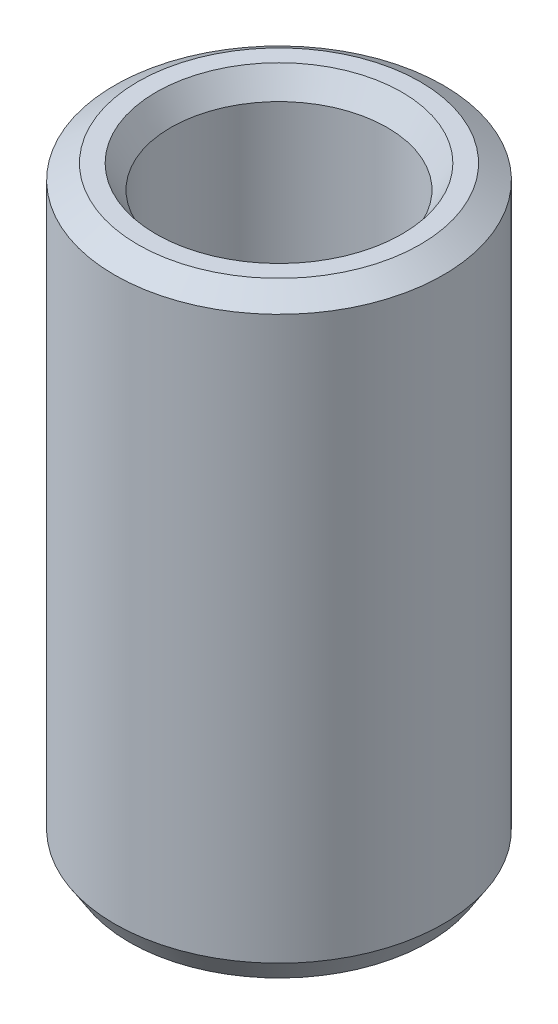
ISO-10303-21;
HEADER;
FILE_DESCRIPTION(('STEP AP214'),'2;1');
FILE_NAME('part.step','',(''),(''),'','','');
FILE_SCHEMA(('AUTOMOTIVE_DESIGN { 1 0 10303 214 1 1 1 1 }'));
ENDSEC;
DATA;
#1=APPLICATION_CONTEXT('core data for automotive mechanical design processes');
#2=APPLICATION_PROTOCOL_DEFINITION('international standard','automotive_design',2000,#1);
#3=PRODUCT_CONTEXT('',#1,'mechanical');
#4=PRODUCT('Part','Part','',(#3));
#5=PRODUCT_RELATED_PRODUCT_CATEGORY('part','',(#4));
#6=PRODUCT_DEFINITION_FORMATION('','',#4);
#7=PRODUCT_DEFINITION_CONTEXT('part definition',#1,'design');
#8=PRODUCT_DEFINITION('design','',#6,#7);
#9=PRODUCT_DEFINITION_SHAPE('','',#8);
#10=(LENGTH_UNIT() NAMED_UNIT(*) SI_UNIT(.MILLI.,.METRE.));
#11=(NAMED_UNIT(*) PLANE_ANGLE_UNIT() SI_UNIT($,.RADIAN.));
#12=(NAMED_UNIT(*) SI_UNIT($,.STERADIAN.) SOLID_ANGLE_UNIT());
#13=UNCERTAINTY_MEASURE_WITH_UNIT(LENGTH_MEASURE(1.E-05),#10,'distance_accuracy_value','');
#14=(GEOMETRIC_REPRESENTATION_CONTEXT(3) GLOBAL_UNCERTAINTY_ASSIGNED_CONTEXT((#13)) GLOBAL_UNIT_ASSIGNED_CONTEXT((#10,
#11,#12)) REPRESENTATION_CONTEXT('',''));
#15=CARTESIAN_POINT('',(0.,0.,0.));
#16=DIRECTION('',(0.,0.,1.));
#17=DIRECTION('',(1.,0.,0.));
#18=AXIS2_PLACEMENT_3D('',#15,#16,#17);
#19=CARTESIAN_POINT('',(0.,63.8823352774952,0.));
#20=DIRECTION('',(0.,-1.,0.));
#21=DIRECTION('',(0.,0.,-1.));
#22=AXIS2_PLACEMENT_3D('',#19,#20,#21);
#23=CYLINDRICAL_SURFACE('',#22,17.5);
#24=CARTESIAN_POINT('',(0.,2.47226229727942,0.));
#25=DIRECTION('',(0.,1.,0.));
#26=DIRECTION('',(0.,0.,1.));
#27=AXIS2_PLACEMENT_3D('',#24,#25,#26);
#28=CIRCLE('',#27,17.5);
#29=CARTESIAN_POINT('',(0.,2.47226229727942,17.5));
#30=VERTEX_POINT('',#29);
#31=EDGE_CURVE('E10',#30,#30,#28,.T.);
#32=ORIENTED_EDGE('',*,*,#31,.T.);
#33=EDGE_LOOP('',(#32));
#34=FACE_BOUND('',#33,.T.);
#35=CARTESIAN_POINT('',(0.,62.3115383944916,0.));
#36=DIRECTION('',(0.,1.,0.));
#37=DIRECTION('',(0.,0.,1.));
#38=AXIS2_PLACEMENT_3D('',#35,#36,#37);
#39=CIRCLE('',#38,17.5);
#40=CARTESIAN_POINT('',(0.,62.3115383944916,17.5));
#41=VERTEX_POINT('',#40);
#42=EDGE_CURVE('E50',#41,#41,#39,.F.);
#43=ORIENTED_EDGE('',*,*,#42,.T.);
#44=EDGE_LOOP('',(#43));
#45=FACE_BOUND('',#44,.T.);
#46=ADVANCED_FACE('F39',(#34,#45),#23,.T.);
#47=CARTESIAN_POINT('',(0.,63.8823352774952,0.));
#48=DIRECTION('',(0.,1.,0.));
#49=DIRECTION('',(0.,0.,1.));
#50=AXIS2_PLACEMENT_3D('',#47,#48,#49);
#51=PLANE('',#50);
#52=CARTESIAN_POINT('',(0.,63.8823352774952,0.));
#53=DIRECTION('',(0.,1.,0.));
#54=DIRECTION('',(0.,0.,1.));
#55=AXIS2_PLACEMENT_3D('',#52,#53,#54);
#56=CIRCLE('',#55,13.0926571755397);
#57=CARTESIAN_POINT('',(0.,63.8823352774952,13.0926571755397));
#58=VERTEX_POINT('',#57);
#59=EDGE_CURVE('E58',#58,#58,#56,.F.);
#60=ORIENTED_EDGE('',*,*,#59,.T.);
#61=EDGE_LOOP('',(#60));
#62=FACE_BOUND('',#61,.T.);
#63=CARTESIAN_POINT('',(0.,63.8823352774952,0.));
#64=DIRECTION('',(0.,1.,0.));
#65=DIRECTION('',(0.,0.,1.));
#66=AXIS2_PLACEMENT_3D('',#63,#64,#65);
#67=CIRCLE('',#66,15.0277377027206);
#68=CARTESIAN_POINT('',(0.,63.8823352774952,15.0277377027206));
#69=VERTEX_POINT('',#68);
#70=EDGE_CURVE('E61',#69,#69,#67,.T.);
#71=ORIENTED_EDGE('',*,*,#70,.T.);
#72=EDGE_LOOP('',(#71));
#73=FACE_BOUND('',#72,.T.);
#74=ADVANCED_FACE('F88',(#62,#73),#51,.T.);
#75=CARTESIAN_POINT('',(0.,0.,0.));
#76=DIRECTION('',(0.,1.,0.));
#77=DIRECTION('',(0.,0.,1.));
#78=AXIS2_PLACEMENT_3D('',#75,#76,#77);
#79=PLANE('',#78);
#80=CARTESIAN_POINT('',(0.,0.,0.));
#81=DIRECTION('',(0.,1.,0.));
#82=DIRECTION('',(0.,0.,1.));
#83=AXIS2_PLACEMENT_3D('',#80,#81,#82);
#84=CIRCLE('',#83,13.9941225898156);
#85=CARTESIAN_POINT('',(0.,0.,13.9941225898156));
#86=VERTEX_POINT('',#85);
#87=EDGE_CURVE('E51',#86,#86,#84,.T.);
#88=ORIENTED_EDGE('',*,*,#87,.T.);
#89=EDGE_LOOP('',(#88));
#90=FACE_BOUND('',#89,.T.);
#91=CARTESIAN_POINT('',(0.,0.,0.));
#92=DIRECTION('',(0.,1.,0.));
#93=DIRECTION('',(0.,0.,1.));
#94=AXIS2_PLACEMENT_3D('',#91,#92,#93);
#95=CIRCLE('',#94,15.9292031169964);
#96=CARTESIAN_POINT('',(0.,0.,15.9292031169964));
#97=VERTEX_POINT('',#96);
#98=EDGE_CURVE('E54',#97,#97,#95,.F.);
#99=ORIENTED_EDGE('',*,*,#98,.T.);
#100=EDGE_LOOP('',(#99));
#101=FACE_BOUND('',#100,.T.);
#102=ADVANCED_FACE('F83',(#90,#101),#79,.F.);
#103=CARTESIAN_POINT('',(0.,63.8823352774952,0.));
#104=DIRECTION('',(0.,-1.,0.));
#105=DIRECTION('',(0.,0.,-1.));
#106=AXIS2_PLACEMENT_3D('',#103,#104,#105);
#107=CYLINDRICAL_SURFACE('',#106,11.5218602925361);
#108=CARTESIAN_POINT('',(0.,61.4100729802158,0.));
#109=DIRECTION('',(0.,1.,0.));
#110=DIRECTION('',(0.,0.,1.));
#111=AXIS2_PLACEMENT_3D('',#108,#109,#110);
#112=CIRCLE('',#111,11.5218602925361);
#113=CARTESIAN_POINT('',(0.,61.4100729802158,11.5218602925361));
#114=VERTEX_POINT('',#113);
#115=EDGE_CURVE('E67',#114,#114,#112,.T.);
#116=ORIENTED_EDGE('',*,*,#115,.T.);
#117=EDGE_LOOP('',(#116));
#118=FACE_BOUND('',#117,.T.);
#119=CARTESIAN_POINT('',(0.,1.57079688300361,0.));
#120=DIRECTION('',(0.,1.,0.));
#121=DIRECTION('',(0.,0.,1.));
#122=AXIS2_PLACEMENT_3D('',#119,#120,#121);
#123=CIRCLE('',#122,11.5218602925361);
#124=CARTESIAN_POINT('',(0.,1.57079688300361,11.5218602925361));
#125=VERTEX_POINT('',#124);
#126=EDGE_CURVE('E69',#125,#125,#123,.F.);
#127=ORIENTED_EDGE('',*,*,#126,.T.);
#128=EDGE_LOOP('',(#127));
#129=FACE_BOUND('',#128,.T.);
#130=ADVANCED_FACE('F71',(#118,#129),#107,.F.);
#131=CARTESIAN_POINT('',(0.,61.4100729802158,0.));
#132=DIRECTION('',(0.,1.,0.));
#133=DIRECTION('',(0.,0.,1.));
#134=AXIS2_PLACEMENT_3D('',#131,#132,#133);
#135=CONICAL_SURFACE('',#134,11.5218602925361,0.566020392310707);
#136=ORIENTED_EDGE('',*,*,#59,.F.);
#137=EDGE_LOOP('',(#136));
#138=FACE_BOUND('',#137,.T.);
#139=ORIENTED_EDGE('',*,*,#115,.F.);
#140=EDGE_LOOP('',(#139));
#141=FACE_BOUND('',#140,.T.);
#142=ADVANCED_FACE('F77',(#138,#141),#135,.F.);
#143=CARTESIAN_POINT('',(0.,0.,0.));
#144=DIRECTION('',(0.,-1.,0.));
#145=DIRECTION('',(0.,0.,-1.));
#146=AXIS2_PLACEMENT_3D('',#143,#144,#145);
#147=CONICAL_SURFACE('',#146,13.9941225898156,1.00477593448419);
#148=ORIENTED_EDGE('',*,*,#126,.F.);
#149=EDGE_LOOP('',(#148));
#150=FACE_BOUND('',#149,.T.);
#151=ORIENTED_EDGE('',*,*,#87,.F.);
#152=EDGE_LOOP('',(#151));
#153=FACE_BOUND('',#152,.T.);
#154=ADVANCED_FACE('F73',(#150,#153),#147,.F.);
#155=CARTESIAN_POINT('',(0.,2.47226229727942,0.));
#156=DIRECTION('',(0.,1.,0.));
#157=DIRECTION('',(0.,0.,1.));
#158=AXIS2_PLACEMENT_3D('',#155,#156,#157);
#159=CONICAL_SURFACE('',#158,17.5,0.566020392310707);
#160=ORIENTED_EDGE('',*,*,#98,.F.);
#161=EDGE_LOOP('',(#160));
#162=FACE_BOUND('',#161,.T.);
#163=ORIENTED_EDGE('',*,*,#31,.F.);
#164=EDGE_LOOP('',(#163));
#165=FACE_BOUND('',#164,.T.);
#166=ADVANCED_FACE('F76',(#162,#165),#159,.T.);
#167=CARTESIAN_POINT('',(0.,63.8823352774952,0.));
#168=DIRECTION('',(0.,-1.,0.));
#169=DIRECTION('',(0.,0.,-1.));
#170=AXIS2_PLACEMENT_3D('',#167,#168,#169);
#171=CONICAL_SURFACE('',#170,15.0277377027206,1.00477593448418);
#172=ORIENTED_EDGE('',*,*,#42,.F.);
#173=EDGE_LOOP('',(#172));
#174=FACE_BOUND('',#173,.T.);
#175=ORIENTED_EDGE('',*,*,#70,.F.);
#176=EDGE_LOOP('',(#175));
#177=FACE_BOUND('',#176,.T.);
#178=ADVANCED_FACE('F45',(#174,#177),#171,.T.);
#179=CLOSED_SHELL('',(#46,#74,#102,#130,#142,#154,#166,#178));
#180=MANIFOLD_SOLID_BREP('B2',#179);
#181=ADVANCED_BREP_SHAPE_REPRESENTATION('',(#18,#180),#14);
#182=SHAPE_DEFINITION_REPRESENTATION(#9,#181);
ENDSEC;
END-ISO-10303-21;
